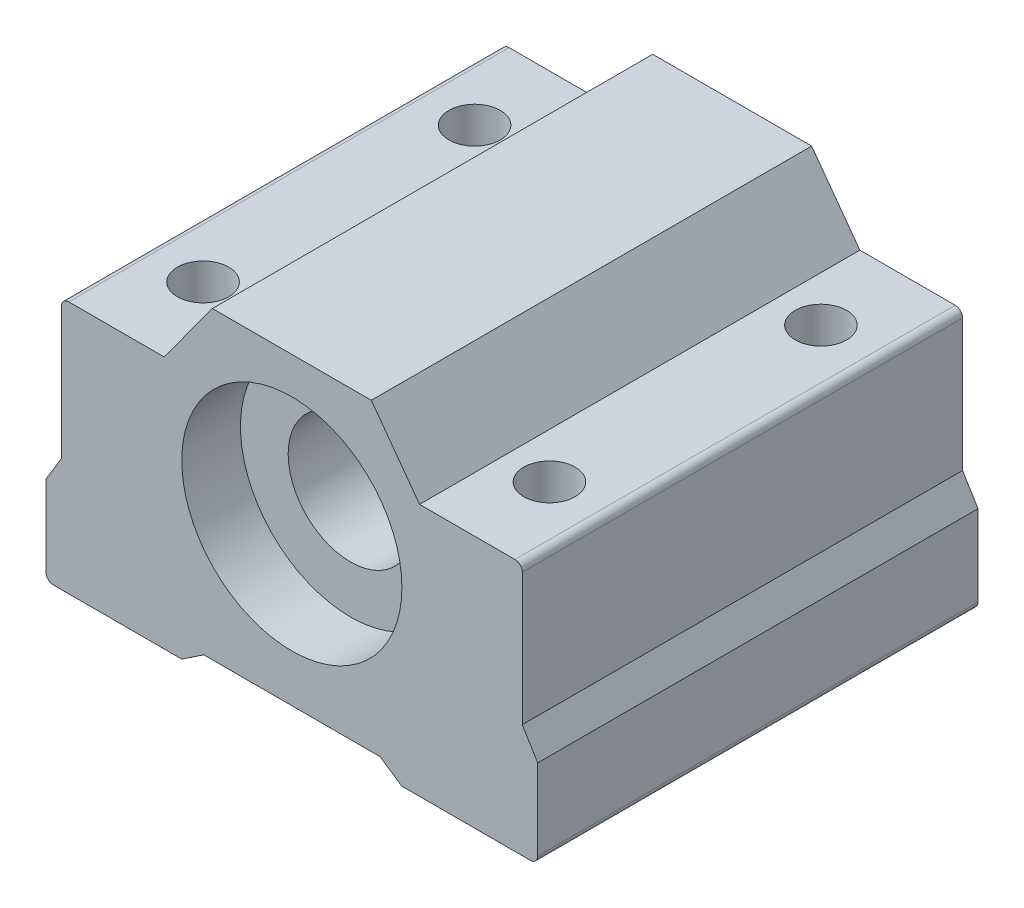
ISO-10303-21;
HEADER;
FILE_DESCRIPTION(('STEP AP214'),'2;1');
FILE_NAME('part.step','',(''),(''),'','','');
FILE_SCHEMA(('AUTOMOTIVE_DESIGN { 1 0 10303 214 1 1 1 1 }'));
ENDSEC;
DATA;
#1=APPLICATION_CONTEXT('core data for automotive mechanical design processes');
#2=APPLICATION_PROTOCOL_DEFINITION('international standard','automotive_design',2000,#1);
#3=PRODUCT_CONTEXT('',#1,'mechanical');
#4=PRODUCT('Part','Part','',(#3));
#5=PRODUCT_RELATED_PRODUCT_CATEGORY('part','',(#4));
#6=PRODUCT_DEFINITION_FORMATION('','',#4);
#7=PRODUCT_DEFINITION_CONTEXT('part definition',#1,'design');
#8=PRODUCT_DEFINITION('design','',#6,#7);
#9=PRODUCT_DEFINITION_SHAPE('','',#8);
#10=(LENGTH_UNIT() NAMED_UNIT(*) SI_UNIT(.MILLI.,.METRE.));
#11=(NAMED_UNIT(*) PLANE_ANGLE_UNIT() SI_UNIT($,.RADIAN.));
#12=(NAMED_UNIT(*) SI_UNIT($,.STERADIAN.) SOLID_ANGLE_UNIT());
#13=UNCERTAINTY_MEASURE_WITH_UNIT(LENGTH_MEASURE(1.E-05),#10,'distance_accuracy_value','');
#14=(GEOMETRIC_REPRESENTATION_CONTEXT(3) GLOBAL_UNCERTAINTY_ASSIGNED_CONTEXT((#13)) GLOBAL_UNIT_ASSIGNED_CONTEXT((#10,
#11,#12)) REPRESENTATION_CONTEXT('',''));
#15=CARTESIAN_POINT('',(0.,0.,0.));
#16=DIRECTION('',(0.,0.,1.));
#17=DIRECTION('',(1.,0.,0.));
#18=AXIS2_PLACEMENT_3D('',#15,#16,#17);
#19=CARTESIAN_POINT('',(-7.5,-17.23,30.));
#20=DIRECTION('',(0.,1.,0.));
#21=DIRECTION('',(0.,0.,1.));
#22=AXIS2_PLACEMENT_3D('',#19,#20,#21);
#23=PLANE('',#22);
#24=CARTESIAN_POINT('',(-11.8,-17.23,5.75));
#25=DIRECTION('',(0.,1.,0.));
#26=DIRECTION('',(0.,0.,1.));
#27=AXIS2_PLACEMENT_3D('',#24,#25,#26);
#28=CIRCLE('',#27,2.25);
#29=CARTESIAN_POINT('',(-11.8,-17.23,8.));
#30=VERTEX_POINT('',#29);
#31=EDGE_CURVE('E326',#30,#30,#28,.T.);
#32=ORIENTED_EDGE('',*,*,#31,.T.);
#33=EDGE_LOOP('',(#32));
#34=FACE_BOUND('',#33,.T.);
#35=CARTESIAN_POINT('',(-11.8,-17.23,24.25));
#36=DIRECTION('',(0.,1.,0.));
#37=DIRECTION('',(0.,0.,1.));
#38=AXIS2_PLACEMENT_3D('',#35,#36,#37);
#39=CIRCLE('',#38,2.25);
#40=CARTESIAN_POINT('',(-11.8,-17.23,26.5));
#41=VERTEX_POINT('',#40);
#42=EDGE_CURVE('E323',#41,#41,#39,.T.);
#43=ORIENTED_EDGE('',*,*,#42,.T.);
#44=EDGE_LOOP('',(#43));
#45=FACE_BOUND('',#44,.T.);
#46=DIRECTION('',(1.,0.,0.));
#47=VECTOR('',#46,1.);
#48=CARTESIAN_POINT('',(-7.5,-17.23,0.));
#49=LINE('',#48,#47);
#50=CARTESIAN_POINT('',(-16.25,-17.23,0.));
#51=VERTEX_POINT('',#50);
#52=CARTESIAN_POINT('',(-7.5,-17.23,0.));
#53=VERTEX_POINT('',#52);
#54=EDGE_CURVE('E226',#51,#53,#49,.T.);
#55=ORIENTED_EDGE('',*,*,#54,.T.);
#56=DIRECTION('',(0.,0.,-1.));
#57=VECTOR('',#56,1.);
#58=CARTESIAN_POINT('',(-7.5,-17.23,30.));
#59=LINE('',#58,#57);
#60=CARTESIAN_POINT('',(-7.5,-17.23,30.));
#61=VERTEX_POINT('',#60);
#62=EDGE_CURVE('E287',#61,#53,#59,.T.);
#63=ORIENTED_EDGE('',*,*,#62,.F.);
#64=DIRECTION('',(1.,0.,0.));
#65=VECTOR('',#64,1.);
#66=CARTESIAN_POINT('',(-7.5,-17.23,30.));
#67=LINE('',#66,#65);
#68=CARTESIAN_POINT('',(-16.25,-17.23,30.));
#69=VERTEX_POINT('',#68);
#70=EDGE_CURVE('E528',#69,#61,#67,.T.);
#71=ORIENTED_EDGE('',*,*,#70,.F.);
#72=DIRECTION('',(0.,0.,-1.));
#73=VECTOR('',#72,1.);
#74=CARTESIAN_POINT('',(-16.25,-17.23,30.));
#75=LINE('',#74,#73);
#76=EDGE_CURVE('E290',#69,#51,#75,.T.);
#77=ORIENTED_EDGE('',*,*,#76,.T.);
#78=EDGE_LOOP('',(#55,#63,#71,#77));
#79=FACE_BOUND('',#78,.T.);
#80=ADVANCED_FACE('F43',(#34,#45,#79),#23,.F.);
#81=CARTESIAN_POINT('',(7.5,-17.23,30.));
#82=DIRECTION('',(0.,1.,0.));
#83=DIRECTION('',(0.,0.,1.));
#84=AXIS2_PLACEMENT_3D('',#81,#82,#83);
#85=PLANE('',#84);
#86=CARTESIAN_POINT('',(11.8,-17.23,5.75));
#87=DIRECTION('',(0.,1.,0.));
#88=DIRECTION('',(0.,0.,1.));
#89=AXIS2_PLACEMENT_3D('',#86,#87,#88);
#90=CIRCLE('',#89,2.25);
#91=CARTESIAN_POINT('',(11.8,-17.23,8.));
#92=VERTEX_POINT('',#91);
#93=EDGE_CURVE('E332',#92,#92,#90,.T.);
#94=ORIENTED_EDGE('',*,*,#93,.T.);
#95=EDGE_LOOP('',(#94));
#96=FACE_BOUND('',#95,.T.);
#97=CARTESIAN_POINT('',(11.8,-17.23,24.25));
#98=DIRECTION('',(0.,1.,0.));
#99=DIRECTION('',(0.,0.,1.));
#100=AXIS2_PLACEMENT_3D('',#97,#98,#99);
#101=CIRCLE('',#100,2.25);
#102=CARTESIAN_POINT('',(11.8,-17.23,26.5));
#103=VERTEX_POINT('',#102);
#104=EDGE_CURVE('E329',#103,#103,#101,.T.);
#105=ORIENTED_EDGE('',*,*,#104,.T.);
#106=EDGE_LOOP('',(#105));
#107=FACE_BOUND('',#106,.T.);
#108=DIRECTION('',(1.,0.,0.));
#109=VECTOR('',#108,1.);
#110=CARTESIAN_POINT('',(7.5,-17.23,0.));
#111=LINE('',#110,#109);
#112=CARTESIAN_POINT('',(7.5,-17.23,0.));
#113=VERTEX_POINT('',#112);
#114=CARTESIAN_POINT('',(16.25,-17.23,0.));
#115=VERTEX_POINT('',#114);
#116=EDGE_CURVE('E234',#113,#115,#111,.T.);
#117=ORIENTED_EDGE('',*,*,#116,.T.);
#118=DIRECTION('',(0.,0.,-1.));
#119=VECTOR('',#118,1.);
#120=CARTESIAN_POINT('',(16.25,-17.23,30.));
#121=LINE('',#120,#119);
#122=CARTESIAN_POINT('',(16.25,-17.23,30.));
#123=VERTEX_POINT('',#122);
#124=EDGE_CURVE('E275',#123,#115,#121,.T.);
#125=ORIENTED_EDGE('',*,*,#124,.F.);
#126=DIRECTION('',(1.,0.,0.));
#127=VECTOR('',#126,1.);
#128=CARTESIAN_POINT('',(7.5,-17.23,30.));
#129=LINE('',#128,#127);
#130=CARTESIAN_POINT('',(7.5,-17.23,30.));
#131=VERTEX_POINT('',#130);
#132=EDGE_CURVE('E493',#131,#123,#129,.T.);
#133=ORIENTED_EDGE('',*,*,#132,.F.);
#134=DIRECTION('',(0.,0.,-1.));
#135=VECTOR('',#134,1.);
#136=CARTESIAN_POINT('',(7.5,-17.23,30.));
#137=LINE('',#136,#135);
#138=EDGE_CURVE('E278',#131,#113,#137,.T.);
#139=ORIENTED_EDGE('',*,*,#138,.T.);
#140=EDGE_LOOP('',(#117,#125,#133,#139));
#141=FACE_BOUND('',#140,.T.);
#142=ADVANCED_FACE('F358',(#96,#107,#141),#85,.F.);
#143=CARTESIAN_POINT('',(8.7,0.,30.));
#144=DIRECTION('',(0.,-1.,0.));
#145=DIRECTION('',(1.,0.,0.));
#146=AXIS2_PLACEMENT_3D('',#143,#144,#145);
#147=PLANE('',#146);
#148=DIRECTION('',(-1.,0.,0.));
#149=VECTOR('',#148,1.);
#150=CARTESIAN_POINT('',(8.7,0.,0.));
#151=LINE('',#150,#149);
#152=CARTESIAN_POINT('',(15.2,0.,0.));
#153=VERTEX_POINT('',#152);
#154=CARTESIAN_POINT('',(8.7,0.,0.));
#155=VERTEX_POINT('',#154);
#156=EDGE_CURVE('E246',#153,#155,#151,.T.);
#157=ORIENTED_EDGE('',*,*,#156,.T.);
#158=DIRECTION('',(0.,0.,-1.));
#159=VECTOR('',#158,1.);
#160=CARTESIAN_POINT('',(8.7,0.,30.));
#161=LINE('',#160,#159);
#162=CARTESIAN_POINT('',(8.7,0.,30.));
#163=VERTEX_POINT('',#162);
#164=EDGE_CURVE('E257',#163,#155,#161,.T.);
#165=ORIENTED_EDGE('',*,*,#164,.F.);
#166=DIRECTION('',(-1.,0.,0.));
#167=VECTOR('',#166,1.);
#168=CARTESIAN_POINT('',(8.7,0.,30.));
#169=LINE('',#168,#167);
#170=CARTESIAN_POINT('',(15.2,0.,30.));
#171=VERTEX_POINT('',#170);
#172=EDGE_CURVE('E505',#171,#163,#169,.T.);
#173=ORIENTED_EDGE('',*,*,#172,.F.);
#174=DIRECTION('',(0.,0.,-1.));
#175=VECTOR('',#174,1.);
#176=CARTESIAN_POINT('',(15.2,0.,30.));
#177=LINE('',#176,#175);
#178=EDGE_CURVE('E260',#171,#153,#177,.T.);
#179=ORIENTED_EDGE('',*,*,#178,.T.);
#180=EDGE_LOOP('',(#157,#165,#173,#179));
#181=FACE_BOUND('',#180,.T.);
#182=CARTESIAN_POINT('',(11.8,0.,24.25));
#183=DIRECTION('',(0.,-1.,0.));
#184=DIRECTION('',(1.,0.,0.));
#185=AXIS2_PLACEMENT_3D('',#182,#183,#184);
#186=CIRCLE('',#185,1.75);
#187=CARTESIAN_POINT('',(13.55,0.,24.25));
#188=VERTEX_POINT('',#187);
#189=EDGE_CURVE('E316',#188,#188,#186,.F.);
#190=ORIENTED_EDGE('',*,*,#189,.F.);
#191=EDGE_LOOP('',(#190));
#192=FACE_BOUND('',#191,.T.);
#193=CARTESIAN_POINT('',(11.8,0.,5.75));
#194=DIRECTION('',(0.,-1.,0.));
#195=DIRECTION('',(1.,0.,0.));
#196=AXIS2_PLACEMENT_3D('',#193,#194,#195);
#197=CIRCLE('',#196,1.75);
#198=CARTESIAN_POINT('',(13.55,0.,5.75));
#199=VERTEX_POINT('',#198);
#200=EDGE_CURVE('E309',#199,#199,#197,.T.);
#201=ORIENTED_EDGE('',*,*,#200,.T.);
#202=EDGE_LOOP('',(#201));
#203=FACE_BOUND('',#202,.T.);
#204=ADVANCED_FACE('F364',(#181,#192,#203),#147,.F.);
#205=CARTESIAN_POINT('',(-15.2,0.,30.));
#206=DIRECTION('',(0.,-1.,0.));
#207=DIRECTION('',(1.,0.,0.));
#208=AXIS2_PLACEMENT_3D('',#205,#206,#207);
#209=PLANE('',#208);
#210=CARTESIAN_POINT('',(-11.8,0.,24.25));
#211=DIRECTION('',(0.,-1.,0.));
#212=DIRECTION('',(1.,0.,0.));
#213=AXIS2_PLACEMENT_3D('',#210,#211,#212);
#214=CIRCLE('',#213,1.75);
#215=CARTESIAN_POINT('',(-10.05,0.,24.25));
#216=VERTEX_POINT('',#215);
#217=EDGE_CURVE('E310',#216,#216,#214,.T.);
#218=ORIENTED_EDGE('',*,*,#217,.T.);
#219=EDGE_LOOP('',(#218));
#220=FACE_BOUND('',#219,.T.);
#221=DIRECTION('',(-1.,0.,0.));
#222=VECTOR('',#221,1.);
#223=CARTESIAN_POINT('',(-15.2,0.,0.));
#224=LINE('',#223,#222);
#225=CARTESIAN_POINT('',(-8.7,0.,0.));
#226=VERTEX_POINT('',#225);
#227=CARTESIAN_POINT('',(-15.2,0.,0.));
#228=VERTEX_POINT('',#227);
#229=EDGE_CURVE('E132',#226,#228,#224,.T.);
#230=ORIENTED_EDGE('',*,*,#229,.T.);
#231=DIRECTION('',(0.,0.,-1.));
#232=VECTOR('',#231,1.);
#233=CARTESIAN_POINT('',(-15.2,0.,30.));
#234=LINE('',#233,#232);
#235=CARTESIAN_POINT('',(-15.2,0.,30.));
#236=VERTEX_POINT('',#235);
#237=EDGE_CURVE('E210',#236,#228,#234,.T.);
#238=ORIENTED_EDGE('',*,*,#237,.F.);
#239=DIRECTION('',(-1.,0.,0.));
#240=VECTOR('',#239,1.);
#241=CARTESIAN_POINT('',(-15.2,0.,30.));
#242=LINE('',#241,#240);
#243=CARTESIAN_POINT('',(-8.7,0.,30.));
#244=VERTEX_POINT('',#243);
#245=EDGE_CURVE('E61',#244,#236,#242,.T.);
#246=ORIENTED_EDGE('',*,*,#245,.F.);
#247=DIRECTION('',(0.,0.,-1.));
#248=VECTOR('',#247,1.);
#249=CARTESIAN_POINT('',(-8.7,0.,30.));
#250=LINE('',#249,#248);
#251=EDGE_CURVE('E206',#244,#226,#250,.T.);
#252=ORIENTED_EDGE('',*,*,#251,.T.);
#253=EDGE_LOOP('',(#230,#238,#246,#252));
#254=FACE_BOUND('',#253,.T.);
#255=CARTESIAN_POINT('',(-11.8,0.,5.75));
#256=DIRECTION('',(0.,-1.,0.));
#257=DIRECTION('',(1.,0.,0.));
#258=AXIS2_PLACEMENT_3D('',#255,#256,#257);
#259=CIRCLE('',#258,1.75);
#260=CARTESIAN_POINT('',(-10.05,0.,5.75));
#261=VERTEX_POINT('',#260);
#262=EDGE_CURVE('E313',#261,#261,#259,.F.);
#263=ORIENTED_EDGE('',*,*,#262,.F.);
#264=EDGE_LOOP('',(#263));
#265=FACE_BOUND('',#264,.T.);
#266=ADVANCED_FACE('F390',(#220,#254,#265),#209,.F.);
#267=CARTESIAN_POINT('',(-15.2,-0.500000000000003,30.));
#268=DIRECTION('',(0.,0.,-1.));
#269=DIRECTION('',(-1.,0.,0.));
#270=AXIS2_PLACEMENT_3D('',#267,#268,#269);
#271=CYLINDRICAL_SURFACE('',#270,0.500000000000003);
#272=CARTESIAN_POINT('',(-15.2,-0.500000000000003,0.));
#273=DIRECTION('',(0.,0.,1.));
#274=DIRECTION('',(1.,0.,0.));
#275=AXIS2_PLACEMENT_3D('',#272,#273,#274);
#276=CIRCLE('',#275,0.500000000000003);
#277=CARTESIAN_POINT('',(-15.7,-0.500000000000003,0.));
#278=VERTEX_POINT('',#277);
#279=EDGE_CURVE('E214',#228,#278,#276,.T.);
#280=ORIENTED_EDGE('',*,*,#279,.T.);
#281=DIRECTION('',(0.,0.,-1.));
#282=VECTOR('',#281,1.);
#283=CARTESIAN_POINT('',(-15.7,-0.500000000000003,30.));
#284=LINE('',#283,#282);
#285=CARTESIAN_POINT('',(-15.7,-0.500000000000003,30.));
#286=VERTEX_POINT('',#285);
#287=EDGE_CURVE('E302',#286,#278,#284,.T.);
#288=ORIENTED_EDGE('',*,*,#287,.F.);
#289=CARTESIAN_POINT('',(-15.2,-0.500000000000003,30.));
#290=DIRECTION('',(0.,0.,1.));
#291=DIRECTION('',(1.,0.,0.));
#292=AXIS2_PLACEMENT_3D('',#289,#290,#291);
#293=CIRCLE('',#292,0.500000000000003);
#294=EDGE_CURVE('E253',#236,#286,#293,.T.);
#295=ORIENTED_EDGE('',*,*,#294,.F.);
#296=ORIENTED_EDGE('',*,*,#237,.T.);
#297=EDGE_LOOP('',(#280,#288,#295,#296));
#298=FACE_BOUND('',#297,.T.);
#299=ADVANCED_FACE('F387',(#298),#271,.T.);
#300=CARTESIAN_POINT('',(-15.7,-0.500000000000003,30.));
#301=DIRECTION('',(1.,0.,0.));
#302=DIRECTION('',(0.,1.,0.));
#303=AXIS2_PLACEMENT_3D('',#300,#301,#302);
#304=PLANE('',#303);
#305=DIRECTION('',(0.,-1.,0.));
#306=VECTOR('',#305,1.);
#307=CARTESIAN_POINT('',(-15.7,-0.500000000000003,0.));
#308=LINE('',#307,#306);
#309=CARTESIAN_POINT('',(-15.7,-9.5,0.));
#310=VERTEX_POINT('',#309);
#311=EDGE_CURVE('E217',#278,#310,#308,.T.);
#312=ORIENTED_EDGE('',*,*,#311,.T.);
#313=DIRECTION('',(0.,0.,-1.));
#314=VECTOR('',#313,1.);
#315=CARTESIAN_POINT('',(-15.7,-9.5,30.));
#316=LINE('',#315,#314);
#317=CARTESIAN_POINT('',(-15.7,-9.5,30.));
#318=VERTEX_POINT('',#317);
#319=EDGE_CURVE('E299',#318,#310,#316,.T.);
#320=ORIENTED_EDGE('',*,*,#319,.F.);
#321=DIRECTION('',(0.,-1.,0.));
#322=VECTOR('',#321,1.);
#323=CARTESIAN_POINT('',(-15.7,-0.500000000000003,30.));
#324=LINE('',#323,#322);
#325=EDGE_CURVE('E141',#286,#318,#324,.T.);
#326=ORIENTED_EDGE('',*,*,#325,.F.);
#327=ORIENTED_EDGE('',*,*,#287,.T.);
#328=EDGE_LOOP('',(#312,#320,#326,#327));
#329=FACE_BOUND('',#328,.T.);
#330=ADVANCED_FACE('F383',(#329),#304,.F.);
#331=CARTESIAN_POINT('',(-15.7,-9.5,30.));
#332=DIRECTION('',(0.854865794548173,-0.518849181662186,0.));
#333=DIRECTION('',(0.518849181662186,0.854865794548173,0.));
#334=AXIS2_PLACEMENT_3D('',#331,#332,#333);
#335=PLANE('',#334);
#336=DIRECTION('',(-0.518849181662186,-0.854865794548173,0.));
#337=VECTOR('',#336,1.);
#338=CARTESIAN_POINT('',(-15.7,-9.5,0.));
#339=LINE('',#338,#337);
#340=CARTESIAN_POINT('',(-16.75,-11.23,0.));
#341=VERTEX_POINT('',#340);
#342=EDGE_CURVE('E220',#310,#341,#339,.T.);
#343=ORIENTED_EDGE('',*,*,#342,.T.);
#344=DIRECTION('',(0.,0.,-1.));
#345=VECTOR('',#344,1.);
#346=CARTESIAN_POINT('',(-16.75,-11.23,30.));
#347=LINE('',#346,#345);
#348=CARTESIAN_POINT('',(-16.75,-11.23,30.));
#349=VERTEX_POINT('',#348);
#350=EDGE_CURVE('E296',#349,#341,#347,.T.);
#351=ORIENTED_EDGE('',*,*,#350,.F.);
#352=DIRECTION('',(-0.518849181662186,-0.854865794548173,0.));
#353=VECTOR('',#352,1.);
#354=CARTESIAN_POINT('',(-15.7,-9.5,30.));
#355=LINE('',#354,#353);
#356=EDGE_CURVE('E517',#318,#349,#355,.T.);
#357=ORIENTED_EDGE('',*,*,#356,.F.);
#358=ORIENTED_EDGE('',*,*,#319,.T.);
#359=EDGE_LOOP('',(#343,#351,#357,#358));
#360=FACE_BOUND('',#359,.T.);
#361=ADVANCED_FACE('F379',(#360),#335,.F.);
#362=CARTESIAN_POINT('',(-16.75,-16.73,30.));
#363=DIRECTION('',(1.,0.,0.));
#364=DIRECTION('',(0.,1.,0.));
#365=AXIS2_PLACEMENT_3D('',#362,#363,#364);
#366=PLANE('',#365);
#367=DIRECTION('',(0.,-1.,0.));
#368=VECTOR('',#367,1.);
#369=CARTESIAN_POINT('',(-16.75,-16.73,0.));
#370=LINE('',#369,#368);
#371=CARTESIAN_POINT('',(-16.75,-16.73,0.));
#372=VERTEX_POINT('',#371);
#373=EDGE_CURVE('E222',#341,#372,#370,.T.);
#374=ORIENTED_EDGE('',*,*,#373,.T.);
#375=DIRECTION('',(0.,0.,-1.));
#376=VECTOR('',#375,1.);
#377=CARTESIAN_POINT('',(-16.75,-16.73,30.));
#378=LINE('',#377,#376);
#379=CARTESIAN_POINT('',(-16.75,-16.73,30.));
#380=VERTEX_POINT('',#379);
#381=EDGE_CURVE('E293',#380,#372,#378,.T.);
#382=ORIENTED_EDGE('',*,*,#381,.F.);
#383=DIRECTION('',(0.,-1.,0.));
#384=VECTOR('',#383,1.);
#385=CARTESIAN_POINT('',(-16.75,-16.73,30.));
#386=LINE('',#385,#384);
#387=EDGE_CURVE('E524',#349,#380,#386,.T.);
#388=ORIENTED_EDGE('',*,*,#387,.F.);
#389=ORIENTED_EDGE('',*,*,#350,.T.);
#390=EDGE_LOOP('',(#374,#382,#388,#389));
#391=FACE_BOUND('',#390,.T.);
#392=ADVANCED_FACE('F375',(#391),#366,.F.);
#393=CARTESIAN_POINT('',(-16.25,-16.73,30.));
#394=DIRECTION('',(0.,0.,-1.));
#395=DIRECTION('',(-1.,0.,0.));
#396=AXIS2_PLACEMENT_3D('',#393,#394,#395);
#397=CYLINDRICAL_SURFACE('',#396,0.5);
#398=CARTESIAN_POINT('',(-16.25,-16.73,0.));
#399=DIRECTION('',(0.,0.,1.));
#400=DIRECTION('',(-1.,0.,0.));
#401=AXIS2_PLACEMENT_3D('',#398,#399,#400);
#402=CIRCLE('',#401,0.5);
#403=EDGE_CURVE('E224',#372,#51,#402,.T.);
#404=ORIENTED_EDGE('',*,*,#403,.T.);
#405=ORIENTED_EDGE('',*,*,#76,.F.);
#406=CARTESIAN_POINT('',(-16.25,-16.73,30.));
#407=DIRECTION('',(0.,0.,1.));
#408=DIRECTION('',(-1.,0.,0.));
#409=AXIS2_PLACEMENT_3D('',#406,#407,#408);
#410=CIRCLE('',#409,0.5);
#411=EDGE_CURVE('E526',#380,#69,#410,.T.);
#412=ORIENTED_EDGE('',*,*,#411,.F.);
#413=ORIENTED_EDGE('',*,*,#381,.T.);
#414=EDGE_LOOP('',(#404,#405,#412,#413));
#415=FACE_BOUND('',#414,.T.);
#416=ADVANCED_FACE('F372',(#415),#397,.T.);
#417=CARTESIAN_POINT('',(-6.,-16.23,30.));
#418=DIRECTION('',(-0.55470019622523,0.832050294337843,0.));
#419=DIRECTION('',(-0.832050294337843,-0.55470019622523,0.));
#420=AXIS2_PLACEMENT_3D('',#417,#418,#419);
#421=PLANE('',#420);
#422=DIRECTION('',(0.832050294337843,0.55470019622523,0.));
#423=VECTOR('',#422,1.);
#424=CARTESIAN_POINT('',(-6.,-16.23,0.));
#425=LINE('',#424,#423);
#426=CARTESIAN_POINT('',(-6.,-16.23,0.));
#427=VERTEX_POINT('',#426);
#428=EDGE_CURVE('E228',#53,#427,#425,.T.);
#429=ORIENTED_EDGE('',*,*,#428,.T.);
#430=DIRECTION('',(0.,0.,-1.));
#431=VECTOR('',#430,1.);
#432=CARTESIAN_POINT('',(-6.,-16.23,30.));
#433=LINE('',#432,#431);
#434=CARTESIAN_POINT('',(-6.,-16.23,30.));
#435=VERTEX_POINT('',#434);
#436=EDGE_CURVE('E284',#435,#427,#433,.T.);
#437=ORIENTED_EDGE('',*,*,#436,.F.);
#438=DIRECTION('',(0.832050294337843,0.55470019622523,0.));
#439=VECTOR('',#438,1.);
#440=CARTESIAN_POINT('',(-6.,-16.23,30.));
#441=LINE('',#440,#439);
#442=EDGE_CURVE('E530',#61,#435,#441,.T.);
#443=ORIENTED_EDGE('',*,*,#442,.F.);
#444=ORIENTED_EDGE('',*,*,#62,.T.);
#445=EDGE_LOOP('',(#429,#437,#443,#444));
#446=FACE_BOUND('',#445,.T.);
#447=ADVANCED_FACE('F370',(#446),#421,.F.);
#448=CARTESIAN_POINT('',(-6.,-16.23,30.));
#449=DIRECTION('',(0.,1.,0.));
#450=DIRECTION('',(-1.,0.,0.));
#451=AXIS2_PLACEMENT_3D('',#448,#449,#450);
#452=PLANE('',#451);
#453=DIRECTION('',(1.,0.,0.));
#454=VECTOR('',#453,1.);
#455=CARTESIAN_POINT('',(-6.,-16.23,0.));
#456=LINE('',#455,#454);
#457=CARTESIAN_POINT('',(6.,-16.23,0.));
#458=VERTEX_POINT('',#457);
#459=EDGE_CURVE('E230',#427,#458,#456,.T.);
#460=ORIENTED_EDGE('',*,*,#459,.T.);
#461=DIRECTION('',(0.,0.,-1.));
#462=VECTOR('',#461,1.);
#463=CARTESIAN_POINT('',(6.,-16.23,30.));
#464=LINE('',#463,#462);
#465=CARTESIAN_POINT('',(6.,-16.23,30.));
#466=VERTEX_POINT('',#465);
#467=EDGE_CURVE('E281',#466,#458,#464,.T.);
#468=ORIENTED_EDGE('',*,*,#467,.F.);
#469=DIRECTION('',(1.,0.,0.));
#470=VECTOR('',#469,1.);
#471=CARTESIAN_POINT('',(-6.,-16.23,30.));
#472=LINE('',#471,#470);
#473=EDGE_CURVE('E532',#435,#466,#472,.T.);
#474=ORIENTED_EDGE('',*,*,#473,.F.);
#475=ORIENTED_EDGE('',*,*,#436,.T.);
#476=EDGE_LOOP('',(#460,#468,#474,#475));
#477=FACE_BOUND('',#476,.T.);
#478=ADVANCED_FACE('F463',(#477),#452,.F.);
#479=CARTESIAN_POINT('',(6.,-16.23,30.));
#480=DIRECTION('',(0.554700196225231,0.832050294337842,0.));
#481=DIRECTION('',(-0.832050294337842,0.554700196225231,0.));
#482=AXIS2_PLACEMENT_3D('',#479,#480,#481);
#483=PLANE('',#482);
#484=DIRECTION('',(0.832050294337842,-0.554700196225231,0.));
#485=VECTOR('',#484,1.);
#486=CARTESIAN_POINT('',(6.,-16.23,0.));
#487=LINE('',#486,#485);
#488=EDGE_CURVE('E232',#458,#113,#487,.T.);
#489=ORIENTED_EDGE('',*,*,#488,.T.);
#490=ORIENTED_EDGE('',*,*,#138,.F.);
#491=DIRECTION('',(0.832050294337842,-0.554700196225231,0.));
#492=VECTOR('',#491,1.);
#493=CARTESIAN_POINT('',(6.,-16.23,30.));
#494=LINE('',#493,#492);
#495=EDGE_CURVE('E480',#466,#131,#494,.T.);
#496=ORIENTED_EDGE('',*,*,#495,.F.);
#497=ORIENTED_EDGE('',*,*,#467,.T.);
#498=EDGE_LOOP('',(#489,#490,#496,#497));
#499=FACE_BOUND('',#498,.T.);
#500=ADVANCED_FACE('F459',(#499),#483,.F.);
#501=CARTESIAN_POINT('',(16.25,-16.73,30.));
#502=DIRECTION('',(0.,0.,-1.));
#503=DIRECTION('',(-1.,0.,0.));
#504=AXIS2_PLACEMENT_3D('',#501,#502,#503);
#505=CYLINDRICAL_SURFACE('',#504,0.5);
#506=CARTESIAN_POINT('',(16.25,-16.73,0.));
#507=DIRECTION('',(0.,0.,1.));
#508=DIRECTION('',(1.,0.,0.));
#509=AXIS2_PLACEMENT_3D('',#506,#507,#508);
#510=CIRCLE('',#509,0.5);
#511=CARTESIAN_POINT('',(16.75,-16.73,0.));
#512=VERTEX_POINT('',#511);
#513=EDGE_CURVE('E236',#115,#512,#510,.T.);
#514=ORIENTED_EDGE('',*,*,#513,.T.);
#515=DIRECTION('',(0.,0.,-1.));
#516=VECTOR('',#515,1.);
#517=CARTESIAN_POINT('',(16.75,-16.73,30.));
#518=LINE('',#517,#516);
#519=CARTESIAN_POINT('',(16.75,-16.73,30.));
#520=VERTEX_POINT('',#519);
#521=EDGE_CURVE('E272',#520,#512,#518,.T.);
#522=ORIENTED_EDGE('',*,*,#521,.F.);
#523=CARTESIAN_POINT('',(16.25,-16.73,30.));
#524=DIRECTION('',(0.,0.,1.));
#525=DIRECTION('',(1.,0.,0.));
#526=AXIS2_PLACEMENT_3D('',#523,#524,#525);
#527=CIRCLE('',#526,0.5);
#528=EDGE_CURVE('E490',#123,#520,#527,.T.);
#529=ORIENTED_EDGE('',*,*,#528,.F.);
#530=ORIENTED_EDGE('',*,*,#124,.T.);
#531=EDGE_LOOP('',(#514,#522,#529,#530));
#532=FACE_BOUND('',#531,.T.);
#533=ADVANCED_FACE('F456',(#532),#505,.T.);
#534=CARTESIAN_POINT('',(16.75,-16.73,30.));
#535=DIRECTION('',(-1.,0.,0.));
#536=DIRECTION('',(0.,-1.,0.));
#537=AXIS2_PLACEMENT_3D('',#534,#535,#536);
#538=PLANE('',#537);
#539=DIRECTION('',(0.,1.,0.));
#540=VECTOR('',#539,1.);
#541=CARTESIAN_POINT('',(16.75,-16.73,0.));
#542=LINE('',#541,#540);
#543=CARTESIAN_POINT('',(16.75,-11.23,0.));
#544=VERTEX_POINT('',#543);
#545=EDGE_CURVE('E238',#512,#544,#542,.T.);
#546=ORIENTED_EDGE('',*,*,#545,.T.);
#547=DIRECTION('',(0.,0.,-1.));
#548=VECTOR('',#547,1.);
#549=CARTESIAN_POINT('',(16.75,-11.23,30.));
#550=LINE('',#549,#548);
#551=CARTESIAN_POINT('',(16.75,-11.23,30.));
#552=VERTEX_POINT('',#551);
#553=EDGE_CURVE('E269',#552,#544,#550,.T.);
#554=ORIENTED_EDGE('',*,*,#553,.F.);
#555=DIRECTION('',(0.,1.,0.));
#556=VECTOR('',#555,1.);
#557=CARTESIAN_POINT('',(16.75,-16.73,30.));
#558=LINE('',#557,#556);
#559=EDGE_CURVE('E492',#520,#552,#558,.T.);
#560=ORIENTED_EDGE('',*,*,#559,.F.);
#561=ORIENTED_EDGE('',*,*,#521,.T.);
#562=EDGE_LOOP('',(#546,#554,#560,#561));
#563=FACE_BOUND('',#562,.T.);
#564=ADVANCED_FACE('F452',(#563),#538,.F.);
#565=CARTESIAN_POINT('',(15.7,-9.5,30.));
#566=DIRECTION('',(-0.854865794548173,-0.518849181662186,0.));
#567=DIRECTION('',(0.518849181662186,-0.854865794548173,0.));
#568=AXIS2_PLACEMENT_3D('',#565,#566,#567);
#569=PLANE('',#568);
#570=DIRECTION('',(-0.518849181662186,0.854865794548173,0.));
#571=VECTOR('',#570,1.);
#572=CARTESIAN_POINT('',(15.7,-9.5,0.));
#573=LINE('',#572,#571);
#574=CARTESIAN_POINT('',(15.7,-9.5,0.));
#575=VERTEX_POINT('',#574);
#576=EDGE_CURVE('E240',#544,#575,#573,.T.);
#577=ORIENTED_EDGE('',*,*,#576,.T.);
#578=DIRECTION('',(0.,0.,-1.));
#579=VECTOR('',#578,1.);
#580=CARTESIAN_POINT('',(15.7,-9.5,30.));
#581=LINE('',#580,#579);
#582=CARTESIAN_POINT('',(15.7,-9.5,30.));
#583=VERTEX_POINT('',#582);
#584=EDGE_CURVE('E266',#583,#575,#581,.T.);
#585=ORIENTED_EDGE('',*,*,#584,.F.);
#586=DIRECTION('',(-0.518849181662186,0.854865794548173,0.));
#587=VECTOR('',#586,1.);
#588=CARTESIAN_POINT('',(15.7,-9.5,30.));
#589=LINE('',#588,#587);
#590=EDGE_CURVE('E495',#552,#583,#589,.T.);
#591=ORIENTED_EDGE('',*,*,#590,.F.);
#592=ORIENTED_EDGE('',*,*,#553,.T.);
#593=EDGE_LOOP('',(#577,#585,#591,#592));
#594=FACE_BOUND('',#593,.T.);
#595=ADVANCED_FACE('F448',(#594),#569,.F.);
#596=CARTESIAN_POINT('',(15.7,-0.500000000000003,30.));
#597=DIRECTION('',(-1.,0.,0.));
#598=DIRECTION('',(0.,-1.,0.));
#599=AXIS2_PLACEMENT_3D('',#596,#597,#598);
#600=PLANE('',#599);
#601=DIRECTION('',(0.,1.,0.));
#602=VECTOR('',#601,1.);
#603=CARTESIAN_POINT('',(15.7,-0.500000000000003,0.));
#604=LINE('',#603,#602);
#605=CARTESIAN_POINT('',(15.7,-0.500000000000003,0.));
#606=VERTEX_POINT('',#605);
#607=EDGE_CURVE('E242',#575,#606,#604,.T.);
#608=ORIENTED_EDGE('',*,*,#607,.T.);
#609=DIRECTION('',(0.,0.,-1.));
#610=VECTOR('',#609,1.);
#611=CARTESIAN_POINT('',(15.7,-0.500000000000003,30.));
#612=LINE('',#611,#610);
#613=CARTESIAN_POINT('',(15.7,-0.500000000000003,30.));
#614=VERTEX_POINT('',#613);
#615=EDGE_CURVE('E263',#614,#606,#612,.T.);
#616=ORIENTED_EDGE('',*,*,#615,.F.);
#617=DIRECTION('',(0.,1.,0.));
#618=VECTOR('',#617,1.);
#619=CARTESIAN_POINT('',(15.7,-0.500000000000003,30.));
#620=LINE('',#619,#618);
#621=EDGE_CURVE('E501',#583,#614,#620,.T.);
#622=ORIENTED_EDGE('',*,*,#621,.F.);
#623=ORIENTED_EDGE('',*,*,#584,.T.);
#624=EDGE_LOOP('',(#608,#616,#622,#623));
#625=FACE_BOUND('',#624,.T.);
#626=ADVANCED_FACE('F444',(#625),#600,.F.);
#627=CARTESIAN_POINT('',(15.2,-0.500000000000003,30.));
#628=DIRECTION('',(0.,0.,-1.));
#629=DIRECTION('',(-1.,0.,0.));
#630=AXIS2_PLACEMENT_3D('',#627,#628,#629);
#631=CYLINDRICAL_SURFACE('',#630,0.500000000000003);
#632=CARTESIAN_POINT('',(15.2,-0.500000000000003,0.));
#633=DIRECTION('',(0.,0.,1.));
#634=DIRECTION('',(-1.,0.,0.));
#635=AXIS2_PLACEMENT_3D('',#632,#633,#634);
#636=CIRCLE('',#635,0.500000000000003);
#637=EDGE_CURVE('E244',#606,#153,#636,.T.);
#638=ORIENTED_EDGE('',*,*,#637,.T.);
#639=ORIENTED_EDGE('',*,*,#178,.F.);
#640=CARTESIAN_POINT('',(15.2,-0.500000000000003,30.));
#641=DIRECTION('',(0.,0.,1.));
#642=DIRECTION('',(-1.,0.,0.));
#643=AXIS2_PLACEMENT_3D('',#640,#641,#642);
#644=CIRCLE('',#643,0.500000000000003);
#645=EDGE_CURVE('E503',#614,#171,#644,.T.);
#646=ORIENTED_EDGE('',*,*,#645,.F.);
#647=ORIENTED_EDGE('',*,*,#615,.T.);
#648=EDGE_LOOP('',(#638,#639,#646,#647));
#649=FACE_BOUND('',#648,.T.);
#650=ADVANCED_FACE('F439',(#649),#631,.T.);
#651=CARTESIAN_POINT('',(5.41500000000001,4.5,30.));
#652=DIRECTION('',(-0.807686990835386,-0.589611503309831,0.));
#653=DIRECTION('',(0.589611503309831,-0.807686990835386,0.));
#654=AXIS2_PLACEMENT_3D('',#651,#652,#653);
#655=PLANE('',#654);
#656=DIRECTION('',(-0.589611503309831,0.807686990835386,0.));
#657=VECTOR('',#656,1.);
#658=CARTESIAN_POINT('',(5.41500000000001,4.5,0.));
#659=LINE('',#658,#657);
#660=CARTESIAN_POINT('',(5.41500000000001,4.5,0.));
#661=VERTEX_POINT('',#660);
#662=EDGE_CURVE('E248',#155,#661,#659,.T.);
#663=ORIENTED_EDGE('',*,*,#662,.T.);
#664=DIRECTION('',(0.,0.,-1.));
#665=VECTOR('',#664,1.);
#666=CARTESIAN_POINT('',(5.41500000000001,4.5,30.));
#667=LINE('',#666,#665);
#668=CARTESIAN_POINT('',(5.41500000000001,4.5,30.));
#669=VERTEX_POINT('',#668);
#670=EDGE_CURVE('E205',#669,#661,#667,.T.);
#671=ORIENTED_EDGE('',*,*,#670,.F.);
#672=DIRECTION('',(-0.589611503309831,0.807686990835386,0.));
#673=VECTOR('',#672,1.);
#674=CARTESIAN_POINT('',(5.41500000000001,4.5,30.));
#675=LINE('',#674,#673);
#676=EDGE_CURVE('E196',#163,#669,#675,.T.);
#677=ORIENTED_EDGE('',*,*,#676,.F.);
#678=ORIENTED_EDGE('',*,*,#164,.T.);
#679=EDGE_LOOP('',(#663,#671,#677,#678));
#680=FACE_BOUND('',#679,.T.);
#681=ADVANCED_FACE('F437',(#680),#655,.F.);
#682=CARTESIAN_POINT('',(-5.41499999999999,4.5,30.));
#683=DIRECTION('',(0.,-1.,0.));
#684=DIRECTION('',(0.,0.,-1.));
#685=AXIS2_PLACEMENT_3D('',#682,#683,#684);
#686=PLANE('',#685);
#687=DIRECTION('',(-1.,0.,0.));
#688=VECTOR('',#687,1.);
#689=CARTESIAN_POINT('',(-5.41499999999999,4.5,0.));
#690=LINE('',#689,#688);
#691=CARTESIAN_POINT('',(-5.41499999999999,4.5,0.));
#692=VERTEX_POINT('',#691);
#693=EDGE_CURVE('E204',#661,#692,#690,.T.);
#694=ORIENTED_EDGE('',*,*,#693,.T.);
#695=DIRECTION('',(0.,0.,-1.));
#696=VECTOR('',#695,1.);
#697=CARTESIAN_POINT('',(-5.41499999999999,4.5,30.));
#698=LINE('',#697,#696);
#699=CARTESIAN_POINT('',(-5.41499999999999,4.5,30.));
#700=VERTEX_POINT('',#699);
#701=EDGE_CURVE('E201',#700,#692,#698,.T.);
#702=ORIENTED_EDGE('',*,*,#701,.F.);
#703=DIRECTION('',(-1.,0.,0.));
#704=VECTOR('',#703,1.);
#705=CARTESIAN_POINT('',(-5.41499999999999,4.5,30.));
#706=LINE('',#705,#704);
#707=EDGE_CURVE('E190',#669,#700,#706,.T.);
#708=ORIENTED_EDGE('',*,*,#707,.F.);
#709=ORIENTED_EDGE('',*,*,#670,.T.);
#710=EDGE_LOOP('',(#694,#702,#708,#709));
#711=FACE_BOUND('',#710,.T.);
#712=ADVANCED_FACE('F202',(#711),#686,.F.);
#713=CARTESIAN_POINT('',(-5.41499999999999,4.5,30.));
#714=DIRECTION('',(0.807686990835385,-0.589611503309833,0.));
#715=DIRECTION('',(0.589611503309833,0.807686990835385,0.));
#716=AXIS2_PLACEMENT_3D('',#713,#714,#715);
#717=PLANE('',#716);
#718=DIRECTION('',(-0.589611503309833,-0.807686990835385,0.));
#719=VECTOR('',#718,1.);
#720=CARTESIAN_POINT('',(-5.41499999999999,4.5,0.));
#721=LINE('',#720,#719);
#722=EDGE_CURVE('E126',#692,#226,#721,.T.);
#723=ORIENTED_EDGE('',*,*,#722,.T.);
#724=ORIENTED_EDGE('',*,*,#251,.F.);
#725=DIRECTION('',(-0.589611503309833,-0.807686990835385,0.));
#726=VECTOR('',#725,1.);
#727=CARTESIAN_POINT('',(-5.41499999999999,4.5,30.));
#728=LINE('',#727,#726);
#729=EDGE_CURVE('E194',#700,#244,#728,.T.);
#730=ORIENTED_EDGE('',*,*,#729,.F.);
#731=ORIENTED_EDGE('',*,*,#701,.T.);
#732=EDGE_LOOP('',(#723,#724,#730,#731));
#733=FACE_BOUND('',#732,.T.);
#734=ADVANCED_FACE('F208',(#733),#717,.F.);
#735=CARTESIAN_POINT('',(-15.2,-0.500000000000003,30.));
#736=DIRECTION('',(0.,0.,1.));
#737=DIRECTION('',(1.,0.,0.));
#738=AXIS2_PLACEMENT_3D('',#735,#736,#737);
#739=PLANE('',#738);
#740=CARTESIAN_POINT('',(0.,-5.5,30.));
#741=DIRECTION('',(0.,0.,1.));
#742=DIRECTION('',(1.,0.,0.));
#743=AXIS2_PLACEMENT_3D('',#740,#741,#742);
#744=CIRCLE('',#743,7.5);
#745=CARTESIAN_POINT('',(7.5,-5.5,30.));
#746=VERTEX_POINT('',#745);
#747=EDGE_CURVE('E550',#746,#746,#744,.T.);
#748=ORIENTED_EDGE('',*,*,#747,.F.);
#749=EDGE_LOOP('',(#748));
#750=FACE_BOUND('',#749,.T.);
#751=ORIENTED_EDGE('',*,*,#294,.T.);
#752=ORIENTED_EDGE('',*,*,#325,.T.);
#753=ORIENTED_EDGE('',*,*,#356,.T.);
#754=ORIENTED_EDGE('',*,*,#387,.T.);
#755=ORIENTED_EDGE('',*,*,#411,.T.);
#756=ORIENTED_EDGE('',*,*,#70,.T.);
#757=ORIENTED_EDGE('',*,*,#442,.T.);
#758=ORIENTED_EDGE('',*,*,#473,.T.);
#759=ORIENTED_EDGE('',*,*,#495,.T.);
#760=ORIENTED_EDGE('',*,*,#132,.T.);
#761=ORIENTED_EDGE('',*,*,#528,.T.);
#762=ORIENTED_EDGE('',*,*,#559,.T.);
#763=ORIENTED_EDGE('',*,*,#590,.T.);
#764=ORIENTED_EDGE('',*,*,#621,.T.);
#765=ORIENTED_EDGE('',*,*,#645,.T.);
#766=ORIENTED_EDGE('',*,*,#172,.T.);
#767=ORIENTED_EDGE('',*,*,#676,.T.);
#768=ORIENTED_EDGE('',*,*,#707,.T.);
#769=ORIENTED_EDGE('',*,*,#729,.T.);
#770=ORIENTED_EDGE('',*,*,#245,.T.);
#771=EDGE_LOOP('',(#751,#752,#753,#754,#755,#756,#757,#758,#759,#760,#761,#762,#763,#764,#765,
#766,#767,#768,#769,#770));
#772=FACE_BOUND('',#771,.T.);
#773=ADVANCED_FACE('F192',(#750,#772),#739,.T.);
#774=CARTESIAN_POINT('',(-15.2,-0.500000000000003,0.));
#775=DIRECTION('',(0.,0.,1.));
#776=DIRECTION('',(1.,0.,0.));
#777=AXIS2_PLACEMENT_3D('',#774,#775,#776);
#778=PLANE('',#777);
#779=CARTESIAN_POINT('',(0.,-5.5,0.));
#780=DIRECTION('',(0.,0.,1.));
#781=DIRECTION('',(1.,0.,0.));
#782=AXIS2_PLACEMENT_3D('',#779,#780,#781);
#783=CIRCLE('',#782,7.5);
#784=CARTESIAN_POINT('',(7.5,-5.5,0.));
#785=VERTEX_POINT('',#784);
#786=EDGE_CURVE('E520',#785,#785,#783,.T.);
#787=ORIENTED_EDGE('',*,*,#786,.T.);
#788=EDGE_LOOP('',(#787));
#789=FACE_BOUND('',#788,.T.);
#790=ORIENTED_EDGE('',*,*,#279,.F.);
#791=ORIENTED_EDGE('',*,*,#229,.F.);
#792=ORIENTED_EDGE('',*,*,#722,.F.);
#793=ORIENTED_EDGE('',*,*,#693,.F.);
#794=ORIENTED_EDGE('',*,*,#662,.F.);
#795=ORIENTED_EDGE('',*,*,#156,.F.);
#796=ORIENTED_EDGE('',*,*,#637,.F.);
#797=ORIENTED_EDGE('',*,*,#607,.F.);
#798=ORIENTED_EDGE('',*,*,#576,.F.);
#799=ORIENTED_EDGE('',*,*,#545,.F.);
#800=ORIENTED_EDGE('',*,*,#513,.F.);
#801=ORIENTED_EDGE('',*,*,#116,.F.);
#802=ORIENTED_EDGE('',*,*,#488,.F.);
#803=ORIENTED_EDGE('',*,*,#459,.F.);
#804=ORIENTED_EDGE('',*,*,#428,.F.);
#805=ORIENTED_EDGE('',*,*,#54,.F.);
#806=ORIENTED_EDGE('',*,*,#403,.F.);
#807=ORIENTED_EDGE('',*,*,#373,.F.);
#808=ORIENTED_EDGE('',*,*,#342,.F.);
#809=ORIENTED_EDGE('',*,*,#311,.F.);
#810=EDGE_LOOP('',(#790,#791,#792,#793,#794,#795,#796,#797,#798,#799,#800,#801,#802,#803,#804,
#805,#806,#807,#808,#809));
#811=FACE_BOUND('',#810,.T.);
#812=ADVANCED_FACE('F431',(#789,#811),#778,.F.);
#813=CARTESIAN_POINT('',(0.,-5.5,4.));
#814=DIRECTION('',(0.,0.,-1.));
#815=DIRECTION('',(-1.,0.,0.));
#816=AXIS2_PLACEMENT_3D('',#813,#814,#815);
#817=CYLINDRICAL_SURFACE('',#816,7.5);
#818=CARTESIAN_POINT('',(0.,-5.5,4.));
#819=DIRECTION('',(0.,0.,1.));
#820=DIRECTION('',(1.,0.,0.));
#821=AXIS2_PLACEMENT_3D('',#818,#819,#820);
#822=CIRCLE('',#821,7.5);
#823=CARTESIAN_POINT('',(7.5,-5.5,4.));
#824=VERTEX_POINT('',#823);
#825=EDGE_CURVE('E218',#824,#824,#822,.T.);
#826=ORIENTED_EDGE('',*,*,#825,.T.);
#827=EDGE_LOOP('',(#826));
#828=FACE_BOUND('',#827,.T.);
#829=ORIENTED_EDGE('',*,*,#786,.F.);
#830=EDGE_LOOP('',(#829));
#831=FACE_BOUND('',#830,.T.);
#832=ADVANCED_FACE('F564',(#828,#831),#817,.F.);
#833=CARTESIAN_POINT('',(0.,-5.5,4.));
#834=DIRECTION('',(0.,0.,1.));
#835=DIRECTION('',(1.,0.,0.));
#836=AXIS2_PLACEMENT_3D('',#833,#834,#835);
#837=PLANE('',#836);
#838=CARTESIAN_POINT('',(0.,-5.5,4.));
#839=DIRECTION('',(0.,0.,1.));
#840=DIRECTION('',(1.,0.,0.));
#841=AXIS2_PLACEMENT_3D('',#838,#839,#840);
#842=CIRCLE('',#841,4.25);
#843=CARTESIAN_POINT('',(4.25,-5.5,4.));
#844=VERTEX_POINT('',#843);
#845=EDGE_CURVE('E308',#844,#844,#842,.F.);
#846=ORIENTED_EDGE('',*,*,#845,.F.);
#847=EDGE_LOOP('',(#846));
#848=FACE_BOUND('',#847,.T.);
#849=ORIENTED_EDGE('',*,*,#825,.F.);
#850=EDGE_LOOP('',(#849));
#851=FACE_BOUND('',#850,.T.);
#852=ADVANCED_FACE('F560',(#848,#851),#837,.F.);
#853=CARTESIAN_POINT('',(0.,-5.5,26.));
#854=DIRECTION('',(0.,0.,1.));
#855=DIRECTION('',(1.,0.,0.));
#856=AXIS2_PLACEMENT_3D('',#853,#854,#855);
#857=CYLINDRICAL_SURFACE('',#856,7.5);
#858=CARTESIAN_POINT('',(0.,-5.5,26.));
#859=DIRECTION('',(0.,0.,1.));
#860=DIRECTION('',(1.,0.,0.));
#861=AXIS2_PLACEMENT_3D('',#858,#859,#860);
#862=CIRCLE('',#861,7.5);
#863=CARTESIAN_POINT('',(7.5,-5.5,26.));
#864=VERTEX_POINT('',#863);
#865=EDGE_CURVE('E547',#864,#864,#862,.T.);
#866=ORIENTED_EDGE('',*,*,#865,.F.);
#867=EDGE_LOOP('',(#866));
#868=FACE_BOUND('',#867,.T.);
#869=ORIENTED_EDGE('',*,*,#747,.T.);
#870=EDGE_LOOP('',(#869));
#871=FACE_BOUND('',#870,.T.);
#872=ADVANCED_FACE('F563',(#868,#871),#857,.F.);
#873=CARTESIAN_POINT('',(0.,-5.5,26.));
#874=DIRECTION('',(0.,0.,-1.));
#875=DIRECTION('',(1.,0.,0.));
#876=AXIS2_PLACEMENT_3D('',#873,#874,#875);
#877=PLANE('',#876);
#878=CARTESIAN_POINT('',(0.,-5.5,26.));
#879=DIRECTION('',(0.,0.,-1.));
#880=DIRECTION('',(-1.,0.,0.));
#881=AXIS2_PLACEMENT_3D('',#878,#879,#880);
#882=CIRCLE('',#881,4.25);
#883=CARTESIAN_POINT('',(-4.25,-5.5,26.));
#884=VERTEX_POINT('',#883);
#885=EDGE_CURVE('E305',#884,#884,#882,.F.);
#886=ORIENTED_EDGE('',*,*,#885,.F.);
#887=EDGE_LOOP('',(#886));
#888=FACE_BOUND('',#887,.T.);
#889=ORIENTED_EDGE('',*,*,#865,.T.);
#890=EDGE_LOOP('',(#889));
#891=FACE_BOUND('',#890,.T.);
#892=ADVANCED_FACE('F584',(#888,#891),#877,.F.);
#893=CARTESIAN_POINT('',(0.,-5.5,0.));
#894=DIRECTION('',(0.,0.,1.));
#895=DIRECTION('',(1.,0.,0.));
#896=AXIS2_PLACEMENT_3D('',#893,#894,#895);
#897=CYLINDRICAL_SURFACE('',#896,4.25);
#898=ORIENTED_EDGE('',*,*,#885,.T.);
#899=EDGE_LOOP('',(#898));
#900=FACE_BOUND('',#899,.T.);
#901=ORIENTED_EDGE('',*,*,#845,.T.);
#902=EDGE_LOOP('',(#901));
#903=FACE_BOUND('',#902,.T.);
#904=ADVANCED_FACE('F558',(#900,#903),#897,.F.);
#905=CARTESIAN_POINT('',(-11.8,4.5,24.25));
#906=DIRECTION('',(0.,-1.,0.));
#907=DIRECTION('',(0.,0.,-1.));
#908=AXIS2_PLACEMENT_3D('',#905,#906,#907);
#909=CYLINDRICAL_SURFACE('',#908,1.75);
#910=CARTESIAN_POINT('',(-11.8,-16.73,24.25));
#911=DIRECTION('',(0.,1.,0.));
#912=DIRECTION('',(0.,0.,1.));
#913=AXIS2_PLACEMENT_3D('',#910,#911,#912);
#914=CIRCLE('',#913,1.75);
#915=CARTESIAN_POINT('',(-11.8,-16.73,26.));
#916=VERTEX_POINT('',#915);
#917=EDGE_CURVE('E11',#916,#916,#914,.F.);
#918=ORIENTED_EDGE('',*,*,#917,.T.);
#919=EDGE_LOOP('',(#918));
#920=FACE_BOUND('',#919,.T.);
#921=ORIENTED_EDGE('',*,*,#217,.F.);
#922=EDGE_LOOP('',(#921));
#923=FACE_BOUND('',#922,.T.);
#924=ADVANCED_FACE('F417',(#920,#923),#909,.F.);
#925=CARTESIAN_POINT('',(-11.8,4.5,5.75));
#926=DIRECTION('',(0.,-1.,0.));
#927=DIRECTION('',(0.,0.,-1.));
#928=AXIS2_PLACEMENT_3D('',#925,#926,#927);
#929=CYLINDRICAL_SURFACE('',#928,1.75);
#930=CARTESIAN_POINT('',(-11.8,-16.73,5.75));
#931=DIRECTION('',(0.,1.,0.));
#932=DIRECTION('',(0.,0.,1.));
#933=AXIS2_PLACEMENT_3D('',#930,#931,#932);
#934=CIRCLE('',#933,1.75);
#935=CARTESIAN_POINT('',(-11.8,-16.73,7.5));
#936=VERTEX_POINT('',#935);
#937=EDGE_CURVE('E304',#936,#936,#934,.F.);
#938=ORIENTED_EDGE('',*,*,#937,.T.);
#939=EDGE_LOOP('',(#938));
#940=FACE_BOUND('',#939,.T.);
#941=ORIENTED_EDGE('',*,*,#262,.T.);
#942=EDGE_LOOP('',(#941));
#943=FACE_BOUND('',#942,.T.);
#944=ADVANCED_FACE('F414',(#940,#943),#929,.F.);
#945=CARTESIAN_POINT('',(11.8,4.5,24.25));
#946=DIRECTION('',(0.,-1.,0.));
#947=DIRECTION('',(0.,0.,-1.));
#948=AXIS2_PLACEMENT_3D('',#945,#946,#947);
#949=CYLINDRICAL_SURFACE('',#948,1.75);
#950=CARTESIAN_POINT('',(11.8,-16.73,24.25));
#951=DIRECTION('',(0.,1.,0.));
#952=DIRECTION('',(0.,0.,1.));
#953=AXIS2_PLACEMENT_3D('',#950,#951,#952);
#954=CIRCLE('',#953,1.75);
#955=CARTESIAN_POINT('',(11.8,-16.73,26.));
#956=VERTEX_POINT('',#955);
#957=EDGE_CURVE('E53',#956,#956,#954,.F.);
#958=ORIENTED_EDGE('',*,*,#957,.T.);
#959=EDGE_LOOP('',(#958));
#960=FACE_BOUND('',#959,.T.);
#961=ORIENTED_EDGE('',*,*,#189,.T.);
#962=EDGE_LOOP('',(#961));
#963=FACE_BOUND('',#962,.T.);
#964=ADVANCED_FACE('F340',(#960,#963),#949,.F.);
#965=CARTESIAN_POINT('',(11.8,4.5,5.75));
#966=DIRECTION('',(0.,-1.,0.));
#967=DIRECTION('',(0.,0.,-1.));
#968=AXIS2_PLACEMENT_3D('',#965,#966,#967);
#969=CYLINDRICAL_SURFACE('',#968,1.75);
#970=CARTESIAN_POINT('',(11.8,-16.73,5.75));
#971=DIRECTION('',(0.,1.,0.));
#972=DIRECTION('',(0.,0.,1.));
#973=AXIS2_PLACEMENT_3D('',#970,#971,#972);
#974=CIRCLE('',#973,1.75);
#975=CARTESIAN_POINT('',(11.8,-16.73,7.5));
#976=VERTEX_POINT('',#975);
#977=EDGE_CURVE('E335',#976,#976,#974,.F.);
#978=ORIENTED_EDGE('',*,*,#977,.T.);
#979=EDGE_LOOP('',(#978));
#980=FACE_BOUND('',#979,.T.);
#981=ORIENTED_EDGE('',*,*,#200,.F.);
#982=EDGE_LOOP('',(#981));
#983=FACE_BOUND('',#982,.T.);
#984=ADVANCED_FACE('F397',(#980,#983),#969,.F.);
#985=CARTESIAN_POINT('',(-11.8,-16.73,5.75));
#986=DIRECTION('',(0.,-1.,0.));
#987=DIRECTION('',(0.,0.,-1.));
#988=AXIS2_PLACEMENT_3D('',#985,#986,#987);
#989=CONICAL_SURFACE('',#988,1.75,0.785398163397449);
#990=ORIENTED_EDGE('',*,*,#31,.F.);
#991=EDGE_LOOP('',(#990));
#992=FACE_BOUND('',#991,.T.);
#993=ORIENTED_EDGE('',*,*,#937,.F.);
#994=EDGE_LOOP('',(#993));
#995=FACE_BOUND('',#994,.T.);
#996=ADVANCED_FACE('F352',(#992,#995),#989,.F.);
#997=CARTESIAN_POINT('',(11.8,-17.23,5.75));
#998=DIRECTION('',(0.,-1.,0.));
#999=DIRECTION('',(0.,0.,-1.));
#1000=AXIS2_PLACEMENT_3D('',#997,#998,#999);
#1001=CONICAL_SURFACE('',#1000,2.25,0.785398163397449);
#1002=ORIENTED_EDGE('',*,*,#977,.F.);
#1003=EDGE_LOOP('',(#1002));
#1004=FACE_BOUND('',#1003,.T.);
#1005=ORIENTED_EDGE('',*,*,#93,.F.);
#1006=EDGE_LOOP('',(#1005));
#1007=FACE_BOUND('',#1006,.T.);
#1008=ADVANCED_FACE('F345',(#1004,#1007),#1001,.F.);
#1009=CARTESIAN_POINT('',(11.8,-16.73,24.25));
#1010=DIRECTION('',(0.,-1.,0.));
#1011=DIRECTION('',(0.,0.,-1.));
#1012=AXIS2_PLACEMENT_3D('',#1009,#1010,#1011);
#1013=CONICAL_SURFACE('',#1012,1.75,0.785398163397449);
#1014=ORIENTED_EDGE('',*,*,#104,.F.);
#1015=EDGE_LOOP('',(#1014));
#1016=FACE_BOUND('',#1015,.T.);
#1017=ORIENTED_EDGE('',*,*,#957,.F.);
#1018=EDGE_LOOP('',(#1017));
#1019=FACE_BOUND('',#1018,.T.);
#1020=ADVANCED_FACE('F343',(#1016,#1019),#1013,.F.);
#1021=CARTESIAN_POINT('',(-11.8,-17.23,24.25));
#1022=DIRECTION('',(0.,-1.,0.));
#1023=DIRECTION('',(0.,0.,-1.));
#1024=AXIS2_PLACEMENT_3D('',#1021,#1022,#1023);
#1025=CONICAL_SURFACE('',#1024,2.25,0.785398163397439);
#1026=ORIENTED_EDGE('',*,*,#917,.F.);
#1027=EDGE_LOOP('',(#1026));
#1028=FACE_BOUND('',#1027,.T.);
#1029=ORIENTED_EDGE('',*,*,#42,.F.);
#1030=EDGE_LOOP('',(#1029));
#1031=FACE_BOUND('',#1030,.T.);
#1032=ADVANCED_FACE('F46',(#1028,#1031),#1025,.F.);
#1033=CLOSED_SHELL('',(#80,#142,#204,#266,#299,#330,#361,#392,#416,#447,#478,#500,#533,#564,
#595,#626,#650,#681,#712,#734,#773,#812,#832,#852,#872,#892,#904,#924,#944,#964,#984,#996,#1008,
#1020,#1032));
#1034=MANIFOLD_SOLID_BREP('B2',#1033);
#1035=ADVANCED_BREP_SHAPE_REPRESENTATION('',(#18,#1034),#14);
#1036=SHAPE_DEFINITION_REPRESENTATION(#9,#1035);
ENDSEC;
END-ISO-10303-21;
